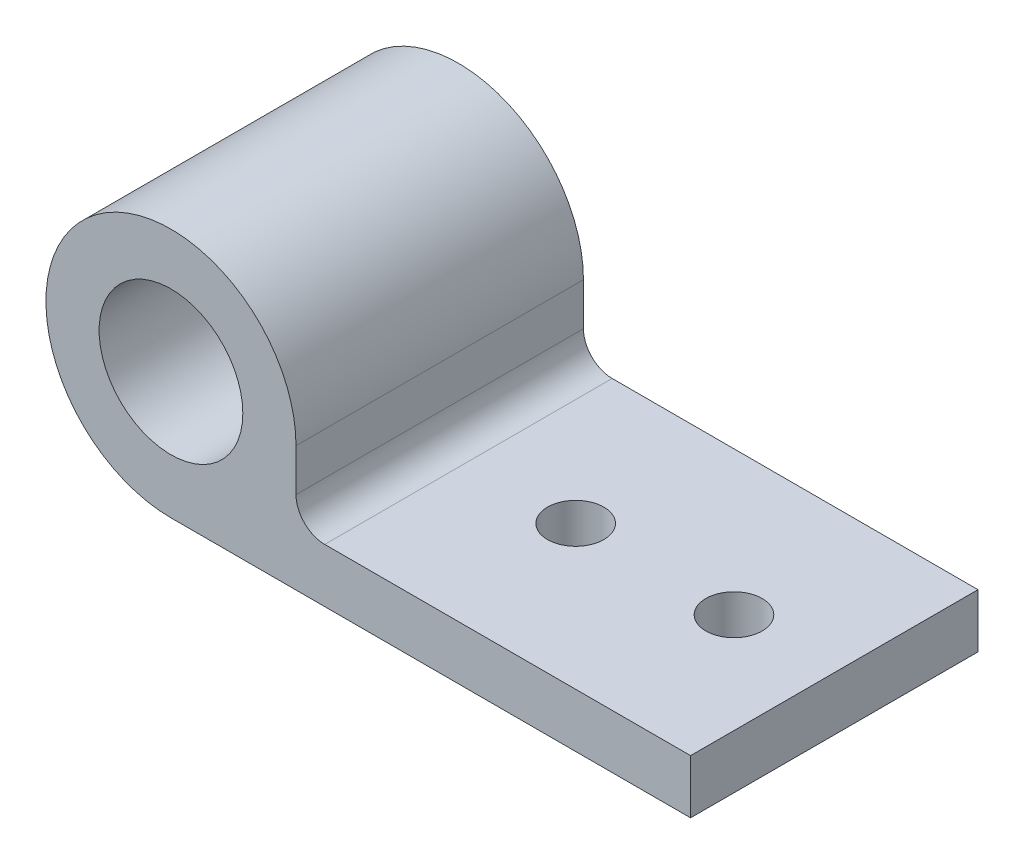
ISO-10303-21;
HEADER;
FILE_DESCRIPTION(('STEP AP214'),'2;1');
FILE_NAME('part.step','',(''),(''),'','','');
FILE_SCHEMA(('AUTOMOTIVE_DESIGN { 1 0 10303 214 1 1 1 1 }'));
ENDSEC;
DATA;
#1=APPLICATION_CONTEXT('core data for automotive mechanical design processes');
#2=APPLICATION_PROTOCOL_DEFINITION('international standard','automotive_design',2000,#1);
#3=PRODUCT_CONTEXT('',#1,'mechanical');
#4=PRODUCT('Part','Part','',(#3));
#5=PRODUCT_RELATED_PRODUCT_CATEGORY('part','',(#4));
#6=PRODUCT_DEFINITION_FORMATION('','',#4);
#7=PRODUCT_DEFINITION_CONTEXT('part definition',#1,'design');
#8=PRODUCT_DEFINITION('design','',#6,#7);
#9=PRODUCT_DEFINITION_SHAPE('','',#8);
#10=(LENGTH_UNIT() NAMED_UNIT(*) SI_UNIT(.MILLI.,.METRE.));
#11=(NAMED_UNIT(*) PLANE_ANGLE_UNIT() SI_UNIT($,.RADIAN.));
#12=(NAMED_UNIT(*) SI_UNIT($,.STERADIAN.) SOLID_ANGLE_UNIT());
#13=UNCERTAINTY_MEASURE_WITH_UNIT(LENGTH_MEASURE(1.E-05),#10,'distance_accuracy_value','');
#14=(GEOMETRIC_REPRESENTATION_CONTEXT(3) GLOBAL_UNCERTAINTY_ASSIGNED_CONTEXT((#13)) GLOBAL_UNIT_ASSIGNED_CONTEXT((#10,
#11,#12)) REPRESENTATION_CONTEXT('',''));
#15=CARTESIAN_POINT('',(0.,0.,0.));
#16=DIRECTION('',(0.,0.,1.));
#17=DIRECTION('',(1.,0.,0.));
#18=AXIS2_PLACEMENT_3D('',#15,#16,#17);
#19=CARTESIAN_POINT('',(13.589,-3.7465,25.4));
#20=DIRECTION('',(0.,0.,-1.));
#21=DIRECTION('',(-1.,0.,0.));
#22=AXIS2_PLACEMENT_3D('',#19,#20,#21);
#23=CYLINDRICAL_SURFACE('',#22,2.54);
#24=DIRECTION('',(0.,0.,1.));
#25=VECTOR('',#24,1.);
#26=CARTESIAN_POINT('',(13.589,-6.2865,25.4));
#27=LINE('',#26,#25);
#28=CARTESIAN_POINT('',(13.589,-6.2865,0.));
#29=VERTEX_POINT('',#28);
#30=CARTESIAN_POINT('',(13.589,-6.2865,25.4));
#31=VERTEX_POINT('',#30);
#32=EDGE_CURVE('E141',#29,#31,#27,.T.);
#33=ORIENTED_EDGE('',*,*,#32,.F.);
#34=CARTESIAN_POINT('',(13.589,-3.7465,0.));
#35=DIRECTION('',(0.,0.,1.));
#36=DIRECTION('',(1.,0.,0.));
#37=AXIS2_PLACEMENT_3D('',#34,#35,#36);
#38=CIRCLE('',#37,2.54);
#39=CARTESIAN_POINT('',(11.049,-3.7465,0.));
#40=VERTEX_POINT('',#39);
#41=EDGE_CURVE('E89',#29,#40,#38,.F.);
#42=ORIENTED_EDGE('',*,*,#41,.T.);
#43=DIRECTION('',(0.,0.,1.));
#44=VECTOR('',#43,1.);
#45=CARTESIAN_POINT('',(11.049,-3.7465,25.4));
#46=LINE('',#45,#44);
#47=CARTESIAN_POINT('',(11.049,-3.7465,25.4));
#48=VERTEX_POINT('',#47);
#49=EDGE_CURVE('E191',#48,#40,#46,.F.);
#50=ORIENTED_EDGE('',*,*,#49,.F.);
#51=CARTESIAN_POINT('',(13.589,-3.7465,25.4));
#52=DIRECTION('',(0.,0.,1.));
#53=DIRECTION('',(1.,0.,0.));
#54=AXIS2_PLACEMENT_3D('',#51,#52,#53);
#55=CIRCLE('',#54,2.54);
#56=EDGE_CURVE('E12',#48,#31,#55,.T.);
#57=ORIENTED_EDGE('',*,*,#56,.T.);
#58=EDGE_LOOP('',(#33,#42,#50,#57));
#59=FACE_BOUND('',#58,.T.);
#60=ADVANCED_FACE('F82',(#59),#23,.F.);
#61=CARTESIAN_POINT('',(0.,-11.049,25.4));
#62=DIRECTION('',(0.,1.,0.));
#63=DIRECTION('',(0.,0.,1.));
#64=AXIS2_PLACEMENT_3D('',#61,#62,#63);
#65=PLANE('',#64);
#66=CARTESIAN_POINT('',(37.0528588893814,-11.049,12.7));
#67=DIRECTION('',(0.,1.,0.));
#68=DIRECTION('',(-1.,0.,0.));
#69=AXIS2_PLACEMENT_3D('',#66,#67,#68);
#70=CIRCLE('',#69,2.4892);
#71=CARTESIAN_POINT('',(34.5636588893814,-11.049,12.7));
#72=VERTEX_POINT('',#71);
#73=EDGE_CURVE('E186',#72,#72,#70,.T.);
#74=ORIENTED_EDGE('',*,*,#73,.T.);
#75=EDGE_LOOP('',(#74));
#76=FACE_BOUND('',#75,.T.);
#77=CARTESIAN_POINT('',(23.0632449919482,-11.049,12.7));
#78=DIRECTION('',(0.,1.,0.));
#79=DIRECTION('',(-1.,0.,0.));
#80=AXIS2_PLACEMENT_3D('',#77,#78,#79);
#81=CIRCLE('',#80,2.4892);
#82=CARTESIAN_POINT('',(20.5740449919482,-11.049,12.7));
#83=VERTEX_POINT('',#82);
#84=EDGE_CURVE('E250',#83,#83,#81,.T.);
#85=ORIENTED_EDGE('',*,*,#84,.T.);
#86=EDGE_LOOP('',(#85));
#87=FACE_BOUND('',#86,.T.);
#88=DIRECTION('',(1.,0.,0.));
#89=VECTOR('',#88,1.);
#90=CARTESIAN_POINT('',(0.,-11.049,0.));
#91=LINE('',#90,#89);
#92=CARTESIAN_POINT('',(0.,-11.049,0.));
#93=VERTEX_POINT('',#92);
#94=CARTESIAN_POINT('',(45.91627088,-11.049,0.));
#95=VERTEX_POINT('',#94);
#96=EDGE_CURVE('E151',#93,#95,#91,.T.);
#97=ORIENTED_EDGE('',*,*,#96,.T.);
#98=DIRECTION('',(0.,0.,-1.));
#99=VECTOR('',#98,1.);
#100=CARTESIAN_POINT('',(45.91627088,-11.049,25.4));
#101=LINE('',#100,#99);
#102=CARTESIAN_POINT('',(45.91627088,-11.049,25.4));
#103=VERTEX_POINT('',#102);
#104=EDGE_CURVE('E142',#103,#95,#101,.T.);
#105=ORIENTED_EDGE('',*,*,#104,.F.);
#106=DIRECTION('',(1.,0.,0.));
#107=VECTOR('',#106,1.);
#108=CARTESIAN_POINT('',(0.,-11.049,25.4));
#109=LINE('',#108,#107);
#110=CARTESIAN_POINT('',(0.,-11.049,25.4));
#111=VERTEX_POINT('',#110);
#112=EDGE_CURVE('E147',#111,#103,#109,.T.);
#113=ORIENTED_EDGE('',*,*,#112,.F.);
#114=DIRECTION('',(0.,0.,-1.));
#115=VECTOR('',#114,1.);
#116=CARTESIAN_POINT('',(0.,-11.049,25.4));
#117=LINE('',#116,#115);
#118=EDGE_CURVE('E132',#111,#93,#117,.T.);
#119=ORIENTED_EDGE('',*,*,#118,.T.);
#120=EDGE_LOOP('',(#97,#105,#113,#119));
#121=FACE_BOUND('',#120,.T.);
#122=ADVANCED_FACE('F153',(#76,#87,#121),#65,.F.);
#123=CARTESIAN_POINT('',(45.91627088,0.,25.4));
#124=DIRECTION('',(-1.,0.,0.));
#125=DIRECTION('',(0.,0.,1.));
#126=AXIS2_PLACEMENT_3D('',#123,#124,#125);
#127=PLANE('',#126);
#128=DIRECTION('',(0.,1.,0.));
#129=VECTOR('',#128,1.);
#130=CARTESIAN_POINT('',(45.91627088,0.,0.));
#131=LINE('',#130,#129);
#132=CARTESIAN_POINT('',(45.91627088,-6.2865,0.));
#133=VERTEX_POINT('',#132);
#134=EDGE_CURVE('E172',#95,#133,#131,.T.);
#135=ORIENTED_EDGE('',*,*,#134,.T.);
#136=DIRECTION('',(0.,0.,-1.));
#137=VECTOR('',#136,1.);
#138=CARTESIAN_POINT('',(45.91627088,-6.2865,25.4));
#139=LINE('',#138,#137);
#140=CARTESIAN_POINT('',(45.91627088,-6.2865,25.4));
#141=VERTEX_POINT('',#140);
#142=EDGE_CURVE('E177',#141,#133,#139,.T.);
#143=ORIENTED_EDGE('',*,*,#142,.F.);
#144=DIRECTION('',(0.,1.,0.));
#145=VECTOR('',#144,1.);
#146=CARTESIAN_POINT('',(45.91627088,0.,25.4));
#147=LINE('',#146,#145);
#148=EDGE_CURVE('E156',#103,#141,#147,.T.);
#149=ORIENTED_EDGE('',*,*,#148,.F.);
#150=ORIENTED_EDGE('',*,*,#104,.T.);
#151=EDGE_LOOP('',(#135,#143,#149,#150));
#152=FACE_BOUND('',#151,.T.);
#153=ADVANCED_FACE('F200',(#152),#127,.F.);
#154=CARTESIAN_POINT('',(0.,-6.28650000000001,25.4));
#155=DIRECTION('',(0.,1.,0.));
#156=DIRECTION('',(-1.,0.,0.));
#157=AXIS2_PLACEMENT_3D('',#154,#155,#156);
#158=PLANE('',#157);
#159=CARTESIAN_POINT('',(37.0528588893814,-6.2865,12.7));
#160=DIRECTION('',(0.,1.,0.));
#161=DIRECTION('',(-1.,0.,0.));
#162=AXIS2_PLACEMENT_3D('',#159,#160,#161);
#163=CIRCLE('',#162,2.4892);
#164=CARTESIAN_POINT('',(34.5636588893814,-6.2865,12.7));
#165=VERTEX_POINT('',#164);
#166=EDGE_CURVE('E246',#165,#165,#163,.T.);
#167=ORIENTED_EDGE('',*,*,#166,.F.);
#168=EDGE_LOOP('',(#167));
#169=FACE_BOUND('',#168,.T.);
#170=CARTESIAN_POINT('',(23.0632449919482,-6.2865,12.7));
#171=DIRECTION('',(0.,1.,0.));
#172=DIRECTION('',(-1.,0.,0.));
#173=AXIS2_PLACEMENT_3D('',#170,#171,#172);
#174=CIRCLE('',#173,2.4892);
#175=CARTESIAN_POINT('',(20.5740449919482,-6.2865,12.7));
#176=VERTEX_POINT('',#175);
#177=EDGE_CURVE('E165',#176,#176,#174,.T.);
#178=ORIENTED_EDGE('',*,*,#177,.F.);
#179=EDGE_LOOP('',(#178));
#180=FACE_BOUND('',#179,.T.);
#181=DIRECTION('',(1.,0.,0.));
#182=VECTOR('',#181,1.);
#183=CARTESIAN_POINT('',(0.,-6.28650000000001,0.));
#184=LINE('',#183,#182);
#185=EDGE_CURVE('E162',#29,#133,#184,.T.);
#186=ORIENTED_EDGE('',*,*,#185,.F.);
#187=ORIENTED_EDGE('',*,*,#32,.T.);
#188=DIRECTION('',(1.,0.,0.));
#189=VECTOR('',#188,1.);
#190=CARTESIAN_POINT('',(0.,-6.28650000000001,25.4));
#191=LINE('',#190,#189);
#192=EDGE_CURVE('E159',#31,#141,#191,.T.);
#193=ORIENTED_EDGE('',*,*,#192,.T.);
#194=ORIENTED_EDGE('',*,*,#142,.T.);
#195=EDGE_LOOP('',(#186,#187,#193,#194));
#196=FACE_BOUND('',#195,.T.);
#197=ADVANCED_FACE('F204',(#169,#180,#196),#158,.T.);
#198=CARTESIAN_POINT('',(11.049,0.,25.4));
#199=DIRECTION('',(1.,0.,0.));
#200=DIRECTION('',(0.,1.,0.));
#201=AXIS2_PLACEMENT_3D('',#198,#199,#200);
#202=PLANE('',#201);
#203=DIRECTION('',(0.,-1.,0.));
#204=VECTOR('',#203,1.);
#205=CARTESIAN_POINT('',(11.049,0.,25.4));
#206=LINE('',#205,#204);
#207=CARTESIAN_POINT('',(11.049,0.,25.4));
#208=VERTEX_POINT('',#207);
#209=EDGE_CURVE('E150',#208,#48,#206,.T.);
#210=ORIENTED_EDGE('',*,*,#209,.T.);
#211=ORIENTED_EDGE('',*,*,#49,.T.);
#212=DIRECTION('',(0.,-1.,0.));
#213=VECTOR('',#212,1.);
#214=CARTESIAN_POINT('',(11.049,0.,0.));
#215=LINE('',#214,#213);
#216=CARTESIAN_POINT('',(11.049,0.,0.));
#217=VERTEX_POINT('',#216);
#218=EDGE_CURVE('E157',#217,#40,#215,.T.);
#219=ORIENTED_EDGE('',*,*,#218,.F.);
#220=DIRECTION('',(0.,0.,-1.));
#221=VECTOR('',#220,1.);
#222=CARTESIAN_POINT('',(11.049,0.,25.4));
#223=LINE('',#222,#221);
#224=EDGE_CURVE('E170',#208,#217,#223,.T.);
#225=ORIENTED_EDGE('',*,*,#224,.F.);
#226=EDGE_LOOP('',(#210,#211,#219,#225));
#227=FACE_BOUND('',#226,.T.);
#228=ADVANCED_FACE('F194',(#227),#202,.T.);
#229=CARTESIAN_POINT('',(0.,0.,0.));
#230=DIRECTION('',(0.,0.,1.));
#231=DIRECTION('',(1.,0.,0.));
#232=AXIS2_PLACEMENT_3D('',#229,#230,#231);
#233=PLANE('',#232);
#234=ORIENTED_EDGE('',*,*,#41,.F.);
#235=ORIENTED_EDGE('',*,*,#185,.T.);
#236=ORIENTED_EDGE('',*,*,#134,.F.);
#237=ORIENTED_EDGE('',*,*,#96,.F.);
#238=CARTESIAN_POINT('',(0.,0.,0.));
#239=DIRECTION('',(0.,0.,1.));
#240=DIRECTION('',(1.,0.,0.));
#241=AXIS2_PLACEMENT_3D('',#238,#239,#240);
#242=CIRCLE('',#241,11.049);
#243=EDGE_CURVE('E137',#217,#93,#242,.T.);
#244=ORIENTED_EDGE('',*,*,#243,.F.);
#245=ORIENTED_EDGE('',*,*,#218,.T.);
#246=EDGE_LOOP('',(#234,#235,#236,#237,#244,#245));
#247=FACE_BOUND('',#246,.T.);
#248=CARTESIAN_POINT('',(0.,0.127,0.));
#249=DIRECTION('',(0.,0.,1.));
#250=DIRECTION('',(1.,0.,0.));
#251=AXIS2_PLACEMENT_3D('',#248,#249,#250);
#252=CIRCLE('',#251,6.35);
#253=CARTESIAN_POINT('',(6.35,0.127,0.));
#254=VERTEX_POINT('',#253);
#255=EDGE_CURVE('E184',#254,#254,#252,.T.);
#256=ORIENTED_EDGE('',*,*,#255,.T.);
#257=EDGE_LOOP('',(#256));
#258=FACE_BOUND('',#257,.T.);
#259=ADVANCED_FACE('F196',(#247,#258),#233,.F.);
#260=CARTESIAN_POINT('',(0.,0.,25.4));
#261=DIRECTION('',(0.,0.,1.));
#262=DIRECTION('',(1.,0.,0.));
#263=AXIS2_PLACEMENT_3D('',#260,#261,#262);
#264=PLANE('',#263);
#265=ORIENTED_EDGE('',*,*,#209,.F.);
#266=CARTESIAN_POINT('',(0.,0.,25.4));
#267=DIRECTION('',(0.,0.,1.));
#268=DIRECTION('',(1.,0.,0.));
#269=AXIS2_PLACEMENT_3D('',#266,#267,#268);
#270=CIRCLE('',#269,11.049);
#271=EDGE_CURVE('E135',#208,#111,#270,.T.);
#272=ORIENTED_EDGE('',*,*,#271,.T.);
#273=ORIENTED_EDGE('',*,*,#112,.T.);
#274=ORIENTED_EDGE('',*,*,#148,.T.);
#275=ORIENTED_EDGE('',*,*,#192,.F.);
#276=ORIENTED_EDGE('',*,*,#56,.F.);
#277=EDGE_LOOP('',(#265,#272,#273,#274,#275,#276));
#278=FACE_BOUND('',#277,.T.);
#279=CARTESIAN_POINT('',(0.,0.127,25.4));
#280=DIRECTION('',(0.,0.,1.));
#281=DIRECTION('',(1.,0.,0.));
#282=AXIS2_PLACEMENT_3D('',#279,#280,#281);
#283=CIRCLE('',#282,6.35);
#284=CARTESIAN_POINT('',(6.35,0.127,25.4));
#285=VERTEX_POINT('',#284);
#286=EDGE_CURVE('E181',#285,#285,#283,.T.);
#287=ORIENTED_EDGE('',*,*,#286,.F.);
#288=EDGE_LOOP('',(#287));
#289=FACE_BOUND('',#288,.T.);
#290=ADVANCED_FACE('F144',(#278,#289),#264,.T.);
#291=CARTESIAN_POINT('',(0.,0.127,25.4));
#292=DIRECTION('',(0.,0.,-1.));
#293=DIRECTION('',(-1.,0.,0.));
#294=AXIS2_PLACEMENT_3D('',#291,#292,#293);
#295=CYLINDRICAL_SURFACE('',#294,6.35);
#296=ORIENTED_EDGE('',*,*,#286,.T.);
#297=EDGE_LOOP('',(#296));
#298=FACE_BOUND('',#297,.T.);
#299=ORIENTED_EDGE('',*,*,#255,.F.);
#300=EDGE_LOOP('',(#299));
#301=FACE_BOUND('',#300,.T.);
#302=ADVANCED_FACE('F219',(#298,#301),#295,.F.);
#303=CARTESIAN_POINT('',(0.,0.,25.4));
#304=DIRECTION('',(0.,0.,-1.));
#305=DIRECTION('',(-1.,0.,0.));
#306=AXIS2_PLACEMENT_3D('',#303,#304,#305);
#307=CYLINDRICAL_SURFACE('',#306,11.049);
#308=ORIENTED_EDGE('',*,*,#243,.T.);
#309=ORIENTED_EDGE('',*,*,#118,.F.);
#310=ORIENTED_EDGE('',*,*,#271,.F.);
#311=ORIENTED_EDGE('',*,*,#224,.T.);
#312=EDGE_LOOP('',(#308,#309,#310,#311));
#313=FACE_BOUND('',#312,.T.);
#314=ADVANCED_FACE('F134',(#313),#307,.T.);
#315=CARTESIAN_POINT('',(23.0632449919482,-11.049,12.7));
#316=DIRECTION('',(0.,1.,0.));
#317=DIRECTION('',(-1.,0.,0.));
#318=AXIS2_PLACEMENT_3D('',#315,#316,#317);
#319=CYLINDRICAL_SURFACE('',#318,2.4892);
#320=ORIENTED_EDGE('',*,*,#84,.F.);
#321=EDGE_LOOP('',(#320));
#322=FACE_BOUND('',#321,.T.);
#323=ORIENTED_EDGE('',*,*,#177,.T.);
#324=EDGE_LOOP('',(#323));
#325=FACE_BOUND('',#324,.T.);
#326=ADVANCED_FACE('F222',(#322,#325),#319,.F.);
#327=CARTESIAN_POINT('',(37.0528588893814,-11.049,12.7));
#328=DIRECTION('',(0.,1.,0.));
#329=DIRECTION('',(-1.,0.,0.));
#330=AXIS2_PLACEMENT_3D('',#327,#328,#329);
#331=CYLINDRICAL_SURFACE('',#330,2.4892);
#332=ORIENTED_EDGE('',*,*,#73,.F.);
#333=EDGE_LOOP('',(#332));
#334=FACE_BOUND('',#333,.T.);
#335=ORIENTED_EDGE('',*,*,#166,.T.);
#336=EDGE_LOOP('',(#335));
#337=FACE_BOUND('',#336,.T.);
#338=ADVANCED_FACE('F227',(#334,#337),#331,.F.);
#339=CLOSED_SHELL('',(#60,#122,#153,#197,#228,#259,#290,#302,#314,#326,#338));
#340=MANIFOLD_SOLID_BREP('B2',#339);
#341=ADVANCED_BREP_SHAPE_REPRESENTATION('',(#18,#340),#14);
#342=SHAPE_DEFINITION_REPRESENTATION(#9,#341);
ENDSEC;
END-ISO-10303-21;
